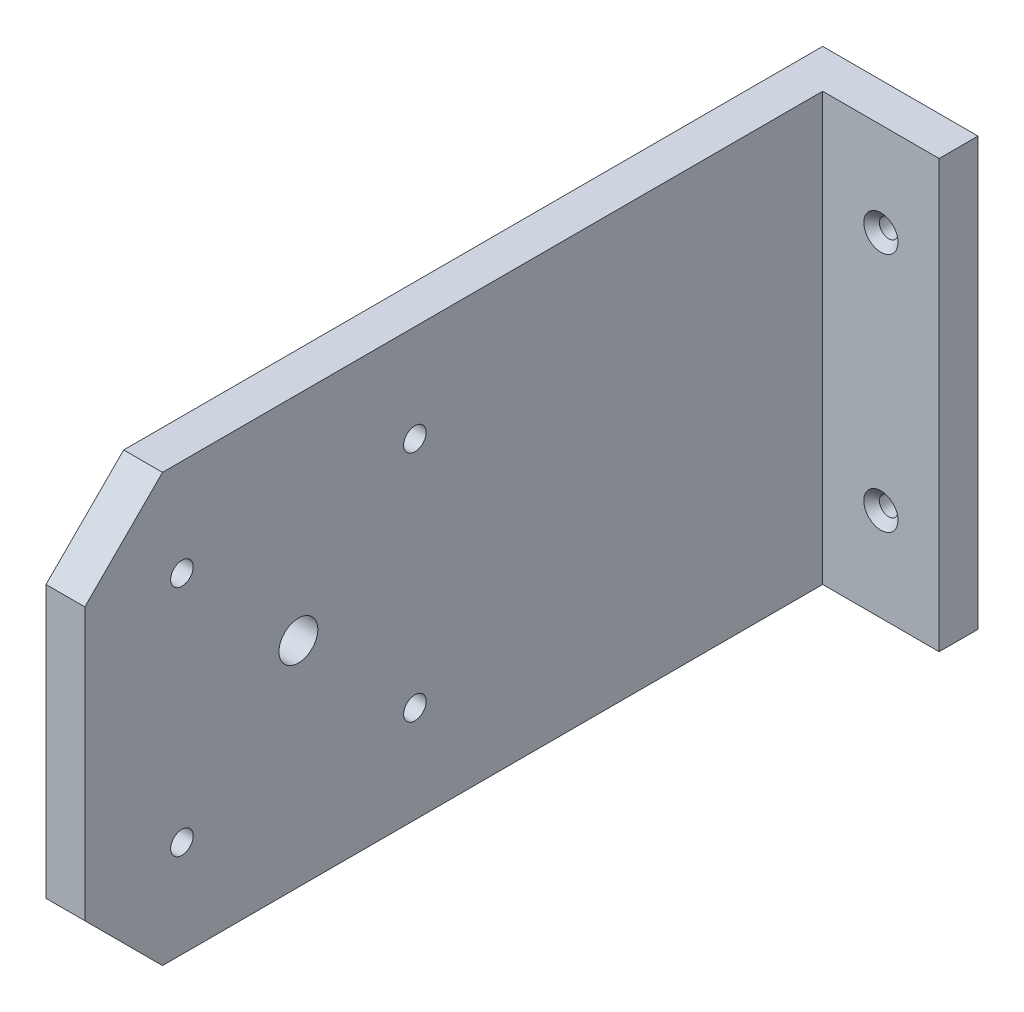
ISO-10303-21;
HEADER;
FILE_DESCRIPTION(('STEP AP214'),'2;1');
FILE_NAME('part.step','',(''),(''),'','','');
FILE_SCHEMA(('AUTOMOTIVE_DESIGN { 1 0 10303 214 1 1 1 1 }'));
ENDSEC;
DATA;
#1=APPLICATION_CONTEXT('core data for automotive mechanical design processes');
#2=APPLICATION_PROTOCOL_DEFINITION('international standard','automotive_design',2000,#1);
#3=PRODUCT_CONTEXT('',#1,'mechanical');
#4=PRODUCT('Part','Part','',(#3));
#5=PRODUCT_RELATED_PRODUCT_CATEGORY('part','',(#4));
#6=PRODUCT_DEFINITION_FORMATION('','',#4);
#7=PRODUCT_DEFINITION_CONTEXT('part definition',#1,'design');
#8=PRODUCT_DEFINITION('design','',#6,#7);
#9=PRODUCT_DEFINITION_SHAPE('','',#8);
#10=(LENGTH_UNIT() NAMED_UNIT(*) SI_UNIT(.MILLI.,.METRE.));
#11=(NAMED_UNIT(*) PLANE_ANGLE_UNIT() SI_UNIT($,.RADIAN.));
#12=(NAMED_UNIT(*) SI_UNIT($,.STERADIAN.) SOLID_ANGLE_UNIT());
#13=UNCERTAINTY_MEASURE_WITH_UNIT(LENGTH_MEASURE(1.E-05),#10,'distance_accuracy_value','');
#14=(GEOMETRIC_REPRESENTATION_CONTEXT(3) GLOBAL_UNCERTAINTY_ASSIGNED_CONTEXT((#13)) GLOBAL_UNIT_ASSIGNED_CONTEXT((#10,
#11,#12)) REPRESENTATION_CONTEXT('',''));
#15=CARTESIAN_POINT('',(0.,0.,0.));
#16=DIRECTION('',(0.,0.,1.));
#17=DIRECTION('',(1.,0.,0.));
#18=AXIS2_PLACEMENT_3D('',#15,#16,#17);
#19=CARTESIAN_POINT('',(0.,0.,0.));
#20=DIRECTION('',(1.,0.,0.));
#21=DIRECTION('',(0.,0.,-1.));
#22=AXIS2_PLACEMENT_3D('',#19,#20,#21);
#23=PLANE('',#22);
#24=DIRECTION('',(0.,0.,-1.));
#25=VECTOR('',#24,1.);
#26=CARTESIAN_POINT('',(0.,-27.5,50.));
#27=LINE('',#26,#25);
#28=CARTESIAN_POINT('',(0.,-27.5,39.9999999999999));
#29=VERTEX_POINT('',#28);
#30=CARTESIAN_POINT('',(0.,-27.5,-50.));
#31=VERTEX_POINT('',#30);
#32=EDGE_CURVE('E123',#29,#31,#27,.T.);
#33=ORIENTED_EDGE('',*,*,#32,.F.);
#34=DIRECTION('',(0.,-0.707106781186544,-0.707106781186551));
#35=VECTOR('',#34,1.);
#36=CARTESIAN_POINT('',(0.,-27.5,39.9999999999999));
#37=LINE('',#36,#35);
#38=CARTESIAN_POINT('',(0.,-17.5,50.));
#39=VERTEX_POINT('',#38);
#40=EDGE_CURVE('E116',#39,#29,#37,.T.);
#41=ORIENTED_EDGE('',*,*,#40,.F.);
#42=DIRECTION('',(0.,-1.,0.));
#43=VECTOR('',#42,1.);
#44=CARTESIAN_POINT('',(0.,27.5,50.));
#45=LINE('',#44,#43);
#46=CARTESIAN_POINT('',(0.,17.4999999999999,50.));
#47=VERTEX_POINT('',#46);
#48=EDGE_CURVE('E115',#47,#39,#45,.T.);
#49=ORIENTED_EDGE('',*,*,#48,.F.);
#50=DIRECTION('',(0.,-0.707106781186551,0.707106781186544));
#51=VECTOR('',#50,1.);
#52=CARTESIAN_POINT('',(0.,27.5,40.));
#53=LINE('',#52,#51);
#54=CARTESIAN_POINT('',(0.,27.5,40.));
#55=VERTEX_POINT('',#54);
#56=EDGE_CURVE('E160',#55,#47,#53,.T.);
#57=ORIENTED_EDGE('',*,*,#56,.F.);
#58=DIRECTION('',(0.,0.,1.));
#59=VECTOR('',#58,1.);
#60=CARTESIAN_POINT('',(0.,27.5,50.));
#61=LINE('',#60,#59);
#62=CARTESIAN_POINT('',(0.,27.5,-50.));
#63=VERTEX_POINT('',#62);
#64=EDGE_CURVE('E133',#63,#55,#61,.T.);
#65=ORIENTED_EDGE('',*,*,#64,.F.);
#66=DIRECTION('',(0.,1.,0.));
#67=VECTOR('',#66,1.);
#68=CARTESIAN_POINT('',(0.,27.5,-50.));
#69=LINE('',#68,#67);
#70=EDGE_CURVE('E130',#31,#63,#69,.T.);
#71=ORIENTED_EDGE('',*,*,#70,.F.);
#72=EDGE_LOOP('',(#33,#41,#49,#57,#65,#71));
#73=FACE_BOUND('',#72,.T.);
#74=CARTESIAN_POINT('',(0.,0.,22.5));
#75=DIRECTION('',(-1.,0.,0.));
#76=DIRECTION('',(0.,0.,1.));
#77=AXIS2_PLACEMENT_3D('',#74,#75,#76);
#78=CIRCLE('',#77,2.49999999999999);
#79=CARTESIAN_POINT('',(0.,0.,25.));
#80=VERTEX_POINT('',#79);
#81=EDGE_CURVE('E184',#80,#80,#78,.T.);
#82=ORIENTED_EDGE('',*,*,#81,.F.);
#83=EDGE_LOOP('',(#82));
#84=FACE_BOUND('',#83,.T.);
#85=CARTESIAN_POINT('',(0.,15.,37.5));
#86=DIRECTION('',(-1.,0.,0.));
#87=DIRECTION('',(0.,0.,1.));
#88=AXIS2_PLACEMENT_3D('',#85,#86,#87);
#89=CIRCLE('',#88,2.75);
#90=CARTESIAN_POINT('',(0.,15.,40.25));
#91=VERTEX_POINT('',#90);
#92=EDGE_CURVE('E196',#91,#91,#89,.T.);
#93=ORIENTED_EDGE('',*,*,#92,.F.);
#94=EDGE_LOOP('',(#93));
#95=FACE_BOUND('',#94,.T.);
#96=CARTESIAN_POINT('',(0.,-15.,37.5));
#97=DIRECTION('',(-1.,0.,0.));
#98=DIRECTION('',(0.,0.,1.));
#99=AXIS2_PLACEMENT_3D('',#96,#97,#98);
#100=CIRCLE('',#99,2.75);
#101=CARTESIAN_POINT('',(0.,-15.,40.25));
#102=VERTEX_POINT('',#101);
#103=EDGE_CURVE('E205',#102,#102,#100,.T.);
#104=ORIENTED_EDGE('',*,*,#103,.F.);
#105=EDGE_LOOP('',(#104));
#106=FACE_BOUND('',#105,.T.);
#107=CARTESIAN_POINT('',(0.,-15.,7.49999999999997));
#108=DIRECTION('',(-1.,0.,0.));
#109=DIRECTION('',(0.,0.,1.));
#110=AXIS2_PLACEMENT_3D('',#107,#108,#109);
#111=CIRCLE('',#110,2.75);
#112=CARTESIAN_POINT('',(0.,-15.,10.25));
#113=VERTEX_POINT('',#112);
#114=EDGE_CURVE('E214',#113,#113,#111,.T.);
#115=ORIENTED_EDGE('',*,*,#114,.F.);
#116=EDGE_LOOP('',(#115));
#117=FACE_BOUND('',#116,.T.);
#118=CARTESIAN_POINT('',(0.,15.,7.49999999999997));
#119=DIRECTION('',(-1.,0.,0.));
#120=DIRECTION('',(0.,0.,1.));
#121=AXIS2_PLACEMENT_3D('',#118,#119,#120);
#122=CIRCLE('',#121,2.75);
#123=CARTESIAN_POINT('',(0.,15.,10.25));
#124=VERTEX_POINT('',#123);
#125=EDGE_CURVE('E223',#124,#124,#122,.T.);
#126=ORIENTED_EDGE('',*,*,#125,.F.);
#127=EDGE_LOOP('',(#126));
#128=FACE_BOUND('',#127,.T.);
#129=ADVANCED_FACE('F33',(#73,#84,#95,#106,#117,#128),#23,.F.);
#130=CARTESIAN_POINT('',(5.,27.5,-50.));
#131=DIRECTION('',(0.,0.,1.));
#132=DIRECTION('',(1.,0.,0.));
#133=AXIS2_PLACEMENT_3D('',#130,#131,#132);
#134=PLANE('',#133);
#135=CARTESIAN_POINT('',(12.5,15.5,-50.));
#136=DIRECTION('',(0.,0.,1.));
#137=DIRECTION('',(1.,0.,0.));
#138=AXIS2_PLACEMENT_3D('',#135,#136,#137);
#139=CIRCLE('',#138,1.2);
#140=CARTESIAN_POINT('',(13.7,15.5,-50.));
#141=VERTEX_POINT('',#140);
#142=EDGE_CURVE('E175',#141,#141,#139,.T.);
#143=ORIENTED_EDGE('',*,*,#142,.T.);
#144=EDGE_LOOP('',(#143));
#145=FACE_BOUND('',#144,.T.);
#146=CARTESIAN_POINT('',(12.5,-15.5,-50.));
#147=DIRECTION('',(0.,0.,1.));
#148=DIRECTION('',(1.,0.,0.));
#149=AXIS2_PLACEMENT_3D('',#146,#147,#148);
#150=CIRCLE('',#149,1.2);
#151=CARTESIAN_POINT('',(13.7,-15.5,-50.));
#152=VERTEX_POINT('',#151);
#153=EDGE_CURVE('E166',#152,#152,#150,.T.);
#154=ORIENTED_EDGE('',*,*,#153,.T.);
#155=EDGE_LOOP('',(#154));
#156=FACE_BOUND('',#155,.T.);
#157=ORIENTED_EDGE('',*,*,#70,.T.);
#158=DIRECTION('',(-1.,0.,0.));
#159=VECTOR('',#158,1.);
#160=CARTESIAN_POINT('',(5.,27.5,-50.));
#161=LINE('',#160,#159);
#162=CARTESIAN_POINT('',(20.,27.5,-50.));
#163=VERTEX_POINT('',#162);
#164=EDGE_CURVE('E11',#163,#63,#161,.T.);
#165=ORIENTED_EDGE('',*,*,#164,.F.);
#166=DIRECTION('',(0.,1.,0.));
#167=VECTOR('',#166,1.);
#168=CARTESIAN_POINT('',(20.,27.5,-50.));
#169=LINE('',#168,#167);
#170=CARTESIAN_POINT('',(20.,-27.5,-50.));
#171=VERTEX_POINT('',#170);
#172=EDGE_CURVE('E144',#171,#163,#169,.T.);
#173=ORIENTED_EDGE('',*,*,#172,.F.);
#174=DIRECTION('',(-1.,0.,0.));
#175=VECTOR('',#174,1.);
#176=CARTESIAN_POINT('',(5.,-27.5,-50.));
#177=LINE('',#176,#175);
#178=EDGE_CURVE('E43',#171,#31,#177,.T.);
#179=ORIENTED_EDGE('',*,*,#178,.T.);
#180=EDGE_LOOP('',(#157,#165,#173,#179));
#181=FACE_BOUND('',#180,.T.);
#182=ADVANCED_FACE('F35',(#145,#156,#181),#134,.F.);
#183=CARTESIAN_POINT('',(5.,27.5,50.));
#184=DIRECTION('',(0.,-1.,0.));
#185=DIRECTION('',(0.,0.,-1.));
#186=AXIS2_PLACEMENT_3D('',#183,#184,#185);
#187=PLANE('',#186);
#188=ORIENTED_EDGE('',*,*,#64,.T.);
#189=DIRECTION('',(-1.,0.,0.));
#190=VECTOR('',#189,1.);
#191=CARTESIAN_POINT('',(20.001025,27.5,40.));
#192=LINE('',#191,#190);
#193=CARTESIAN_POINT('',(5.,27.5,40.));
#194=VERTEX_POINT('',#193);
#195=EDGE_CURVE('E59',#194,#55,#192,.T.);
#196=ORIENTED_EDGE('',*,*,#195,.F.);
#197=DIRECTION('',(0.,0.,1.));
#198=VECTOR('',#197,1.);
#199=CARTESIAN_POINT('',(5.,27.5,50.));
#200=LINE('',#199,#198);
#201=CARTESIAN_POINT('',(5.,27.5,-45.));
#202=VERTEX_POINT('',#201);
#203=EDGE_CURVE('E121',#202,#194,#200,.T.);
#204=ORIENTED_EDGE('',*,*,#203,.F.);
#205=DIRECTION('',(-1.,0.,0.));
#206=VECTOR('',#205,1.);
#207=CARTESIAN_POINT('',(20.,27.5,-45.));
#208=LINE('',#207,#206);
#209=CARTESIAN_POINT('',(20.,27.5,-45.));
#210=VERTEX_POINT('',#209);
#211=EDGE_CURVE('E134',#210,#202,#208,.T.);
#212=ORIENTED_EDGE('',*,*,#211,.F.);
#213=DIRECTION('',(0.,0.,1.));
#214=VECTOR('',#213,1.);
#215=CARTESIAN_POINT('',(20.,27.5,-50.));
#216=LINE('',#215,#214);
#217=EDGE_CURVE('E155',#163,#210,#216,.T.);
#218=ORIENTED_EDGE('',*,*,#217,.F.);
#219=ORIENTED_EDGE('',*,*,#164,.T.);
#220=EDGE_LOOP('',(#188,#196,#204,#212,#218,#219));
#221=FACE_BOUND('',#220,.T.);
#222=ADVANCED_FACE('F237',(#221),#187,.F.);
#223=CARTESIAN_POINT('',(5.,27.5,50.));
#224=DIRECTION('',(0.,0.,-1.));
#225=DIRECTION('',(0.,1.,0.));
#226=AXIS2_PLACEMENT_3D('',#223,#224,#225);
#227=PLANE('',#226);
#228=ORIENTED_EDGE('',*,*,#48,.T.);
#229=DIRECTION('',(-1.,0.,0.));
#230=VECTOR('',#229,1.);
#231=CARTESIAN_POINT('',(20.001025,-17.5,50.));
#232=LINE('',#231,#230);
#233=CARTESIAN_POINT('',(5.,-17.5,50.));
#234=VERTEX_POINT('',#233);
#235=EDGE_CURVE('E51',#234,#39,#232,.T.);
#236=ORIENTED_EDGE('',*,*,#235,.F.);
#237=DIRECTION('',(0.,-1.,0.));
#238=VECTOR('',#237,1.);
#239=CARTESIAN_POINT('',(5.,27.5,50.));
#240=LINE('',#239,#238);
#241=CARTESIAN_POINT('',(5.,17.4999999999999,50.));
#242=VERTEX_POINT('',#241);
#243=EDGE_CURVE('E113',#242,#234,#240,.T.);
#244=ORIENTED_EDGE('',*,*,#243,.F.);
#245=DIRECTION('',(-1.,0.,0.));
#246=VECTOR('',#245,1.);
#247=CARTESIAN_POINT('',(20.001025,17.4999999999999,50.));
#248=LINE('',#247,#246);
#249=EDGE_CURVE('E145',#242,#47,#248,.T.);
#250=ORIENTED_EDGE('',*,*,#249,.T.);
#251=EDGE_LOOP('',(#228,#236,#244,#250));
#252=FACE_BOUND('',#251,.T.);
#253=ADVANCED_FACE('F111',(#252),#227,.F.);
#254=CARTESIAN_POINT('',(5.,-27.5,50.));
#255=DIRECTION('',(0.,1.,0.));
#256=DIRECTION('',(0.,0.,1.));
#257=AXIS2_PLACEMENT_3D('',#254,#255,#256);
#258=PLANE('',#257);
#259=DIRECTION('',(0.,0.,-1.));
#260=VECTOR('',#259,1.);
#261=CARTESIAN_POINT('',(5.,-27.5,50.));
#262=LINE('',#261,#260);
#263=CARTESIAN_POINT('',(5.,-27.5,39.9999999999999));
#264=VERTEX_POINT('',#263);
#265=CARTESIAN_POINT('',(5.,-27.5,-45.));
#266=VERTEX_POINT('',#265);
#267=EDGE_CURVE('E37',#264,#266,#262,.T.);
#268=ORIENTED_EDGE('',*,*,#267,.F.);
#269=DIRECTION('',(-1.,0.,0.));
#270=VECTOR('',#269,1.);
#271=CARTESIAN_POINT('',(20.001025,-27.5,39.9999999999999));
#272=LINE('',#271,#270);
#273=EDGE_CURVE('E102',#264,#29,#272,.T.);
#274=ORIENTED_EDGE('',*,*,#273,.T.);
#275=ORIENTED_EDGE('',*,*,#32,.T.);
#276=ORIENTED_EDGE('',*,*,#178,.F.);
#277=DIRECTION('',(0.,0.,-1.));
#278=VECTOR('',#277,1.);
#279=CARTESIAN_POINT('',(20.,-27.5,-50.));
#280=LINE('',#279,#278);
#281=CARTESIAN_POINT('',(20.,-27.5,-45.));
#282=VERTEX_POINT('',#281);
#283=EDGE_CURVE('E150',#282,#171,#280,.T.);
#284=ORIENTED_EDGE('',*,*,#283,.F.);
#285=DIRECTION('',(-1.,0.,0.));
#286=VECTOR('',#285,1.);
#287=CARTESIAN_POINT('',(20.,-27.5,-45.));
#288=LINE('',#287,#286);
#289=EDGE_CURVE('E146',#282,#266,#288,.T.);
#290=ORIENTED_EDGE('',*,*,#289,.T.);
#291=EDGE_LOOP('',(#268,#274,#275,#276,#284,#290));
#292=FACE_BOUND('',#291,.T.);
#293=ADVANCED_FACE('F244',(#292),#258,.F.);
#294=CARTESIAN_POINT('',(5.,0.,0.));
#295=DIRECTION('',(1.,0.,0.));
#296=DIRECTION('',(0.,0.,-1.));
#297=AXIS2_PLACEMENT_3D('',#294,#295,#296);
#298=PLANE('',#297);
#299=CARTESIAN_POINT('',(5.,15.,7.49999999999997));
#300=DIRECTION('',(1.,0.,0.));
#301=DIRECTION('',(0.,0.,-1.));
#302=AXIS2_PLACEMENT_3D('',#299,#300,#301);
#303=CIRCLE('',#302,1.45);
#304=CARTESIAN_POINT('',(5.,15.,6.04999999999997));
#305=VERTEX_POINT('',#304);
#306=EDGE_CURVE('E217',#305,#305,#303,.T.);
#307=ORIENTED_EDGE('',*,*,#306,.F.);
#308=EDGE_LOOP('',(#307));
#309=FACE_BOUND('',#308,.T.);
#310=CARTESIAN_POINT('',(5.,-15.,7.49999999999997));
#311=DIRECTION('',(1.,0.,0.));
#312=DIRECTION('',(0.,0.,-1.));
#313=AXIS2_PLACEMENT_3D('',#310,#311,#312);
#314=CIRCLE('',#313,1.45);
#315=CARTESIAN_POINT('',(5.,-15.,6.04999999999997));
#316=VERTEX_POINT('',#315);
#317=EDGE_CURVE('E208',#316,#316,#314,.T.);
#318=ORIENTED_EDGE('',*,*,#317,.F.);
#319=EDGE_LOOP('',(#318));
#320=FACE_BOUND('',#319,.T.);
#321=CARTESIAN_POINT('',(5.,-15.,37.5));
#322=DIRECTION('',(1.,0.,0.));
#323=DIRECTION('',(0.,0.,-1.));
#324=AXIS2_PLACEMENT_3D('',#321,#322,#323);
#325=CIRCLE('',#324,1.45);
#326=CARTESIAN_POINT('',(5.,-15.,36.05));
#327=VERTEX_POINT('',#326);
#328=EDGE_CURVE('E199',#327,#327,#325,.T.);
#329=ORIENTED_EDGE('',*,*,#328,.F.);
#330=EDGE_LOOP('',(#329));
#331=FACE_BOUND('',#330,.T.);
#332=CARTESIAN_POINT('',(5.,15.,37.5));
#333=DIRECTION('',(1.,0.,0.));
#334=DIRECTION('',(0.,0.,-1.));
#335=AXIS2_PLACEMENT_3D('',#332,#333,#334);
#336=CIRCLE('',#335,1.45);
#337=CARTESIAN_POINT('',(5.,15.,36.05));
#338=VERTEX_POINT('',#337);
#339=EDGE_CURVE('E188',#338,#338,#336,.T.);
#340=ORIENTED_EDGE('',*,*,#339,.F.);
#341=EDGE_LOOP('',(#340));
#342=FACE_BOUND('',#341,.T.);
#343=CARTESIAN_POINT('',(5.,0.,22.5));
#344=DIRECTION('',(1.,0.,0.));
#345=DIRECTION('',(0.,0.,-1.));
#346=AXIS2_PLACEMENT_3D('',#343,#344,#345);
#347=CIRCLE('',#346,2.49999999999999);
#348=CARTESIAN_POINT('',(5.,0.,20.));
#349=VERTEX_POINT('',#348);
#350=EDGE_CURVE('E185',#349,#349,#347,.F.);
#351=ORIENTED_EDGE('',*,*,#350,.T.);
#352=EDGE_LOOP('',(#351));
#353=FACE_BOUND('',#352,.T.);
#354=DIRECTION('',(0.,-0.707106781186544,-0.707106781186551));
#355=VECTOR('',#354,1.);
#356=CARTESIAN_POINT('',(5.,-27.5,39.9999999999999));
#357=LINE('',#356,#355);
#358=EDGE_CURVE('E99',#234,#264,#357,.T.);
#359=ORIENTED_EDGE('',*,*,#358,.T.);
#360=ORIENTED_EDGE('',*,*,#267,.T.);
#361=DIRECTION('',(0.,-1.,0.));
#362=VECTOR('',#361,1.);
#363=CARTESIAN_POINT('',(5.,27.5,-45.));
#364=LINE('',#363,#362);
#365=EDGE_CURVE('E141',#202,#266,#364,.T.);
#366=ORIENTED_EDGE('',*,*,#365,.F.);
#367=ORIENTED_EDGE('',*,*,#203,.T.);
#368=DIRECTION('',(0.,-0.707106781186551,0.707106781186544));
#369=VECTOR('',#368,1.);
#370=CARTESIAN_POINT('',(5.,27.5,40.));
#371=LINE('',#370,#369);
#372=EDGE_CURVE('E106',#194,#242,#371,.T.);
#373=ORIENTED_EDGE('',*,*,#372,.T.);
#374=ORIENTED_EDGE('',*,*,#243,.T.);
#375=EDGE_LOOP('',(#359,#360,#366,#367,#373,#374));
#376=FACE_BOUND('',#375,.T.);
#377=ADVANCED_FACE('F119',(#309,#320,#331,#342,#353,#376),#298,.T.);
#378=CARTESIAN_POINT('',(20.,27.5,-45.));
#379=DIRECTION('',(0.,0.,-1.));
#380=DIRECTION('',(0.,1.,0.));
#381=AXIS2_PLACEMENT_3D('',#378,#379,#380);
#382=PLANE('',#381);
#383=CARTESIAN_POINT('',(12.5,15.5,-45.));
#384=DIRECTION('',(0.,0.,1.));
#385=DIRECTION('',(1.,0.,0.));
#386=AXIS2_PLACEMENT_3D('',#383,#384,#385);
#387=CIRCLE('',#386,2.2);
#388=CARTESIAN_POINT('',(14.7,15.5,-45.));
#389=VERTEX_POINT('',#388);
#390=EDGE_CURVE('E181',#389,#389,#387,.T.);
#391=ORIENTED_EDGE('',*,*,#390,.F.);
#392=EDGE_LOOP('',(#391));
#393=FACE_BOUND('',#392,.T.);
#394=CARTESIAN_POINT('',(12.5,-15.5,-45.));
#395=DIRECTION('',(0.,0.,1.));
#396=DIRECTION('',(1.,0.,0.));
#397=AXIS2_PLACEMENT_3D('',#394,#395,#396);
#398=CIRCLE('',#397,2.2);
#399=CARTESIAN_POINT('',(14.7,-15.5,-45.));
#400=VERTEX_POINT('',#399);
#401=EDGE_CURVE('E172',#400,#400,#398,.T.);
#402=ORIENTED_EDGE('',*,*,#401,.F.);
#403=EDGE_LOOP('',(#402));
#404=FACE_BOUND('',#403,.T.);
#405=ORIENTED_EDGE('',*,*,#365,.T.);
#406=ORIENTED_EDGE('',*,*,#289,.F.);
#407=DIRECTION('',(0.,-1.,0.));
#408=VECTOR('',#407,1.);
#409=CARTESIAN_POINT('',(20.,27.5,-45.));
#410=LINE('',#409,#408);
#411=EDGE_CURVE('E153',#210,#282,#410,.T.);
#412=ORIENTED_EDGE('',*,*,#411,.F.);
#413=ORIENTED_EDGE('',*,*,#211,.T.);
#414=EDGE_LOOP('',(#405,#406,#412,#413));
#415=FACE_BOUND('',#414,.T.);
#416=ADVANCED_FACE('F267',(#393,#404,#415),#382,.F.);
#417=CARTESIAN_POINT('',(20.,0.,0.));
#418=DIRECTION('',(-1.,0.,0.));
#419=DIRECTION('',(0.,0.,1.));
#420=AXIS2_PLACEMENT_3D('',#417,#418,#419);
#421=PLANE('',#420);
#422=ORIENTED_EDGE('',*,*,#172,.T.);
#423=ORIENTED_EDGE('',*,*,#217,.T.);
#424=ORIENTED_EDGE('',*,*,#411,.T.);
#425=ORIENTED_EDGE('',*,*,#283,.T.);
#426=EDGE_LOOP('',(#422,#423,#424,#425));
#427=FACE_BOUND('',#426,.T.);
#428=ADVANCED_FACE('F259',(#427),#421,.F.);
#429=CARTESIAN_POINT('',(20.001025,27.5,40.));
#430=DIRECTION('',(0.,-0.707106781186544,-0.707106781186551));
#431=DIRECTION('',(0.,0.707106781186551,-0.707106781186544));
#432=AXIS2_PLACEMENT_3D('',#429,#430,#431);
#433=PLANE('',#432);
#434=ORIENTED_EDGE('',*,*,#195,.T.);
#435=ORIENTED_EDGE('',*,*,#56,.T.);
#436=ORIENTED_EDGE('',*,*,#249,.F.);
#437=ORIENTED_EDGE('',*,*,#372,.F.);
#438=EDGE_LOOP('',(#434,#435,#436,#437));
#439=FACE_BOUND('',#438,.T.);
#440=ADVANCED_FACE('F257',(#439),#433,.F.);
#441=CARTESIAN_POINT('',(20.001025,-27.5,39.9999999999999));
#442=DIRECTION('',(0.,0.707106781186551,-0.707106781186544));
#443=DIRECTION('',(0.,0.707106781186544,0.707106781186551));
#444=AXIS2_PLACEMENT_3D('',#441,#442,#443);
#445=PLANE('',#444);
#446=ORIENTED_EDGE('',*,*,#235,.T.);
#447=ORIENTED_EDGE('',*,*,#40,.T.);
#448=ORIENTED_EDGE('',*,*,#273,.F.);
#449=ORIENTED_EDGE('',*,*,#358,.F.);
#450=EDGE_LOOP('',(#446,#447,#448,#449));
#451=FACE_BOUND('',#450,.T.);
#452=ADVANCED_FACE('F100',(#451),#445,.F.);
#453=CARTESIAN_POINT('',(12.5,-15.5,-45.));
#454=DIRECTION('',(0.,0.,1.));
#455=DIRECTION('',(1.,0.,0.));
#456=AXIS2_PLACEMENT_3D('',#453,#454,#455);
#457=CYLINDRICAL_SURFACE('',#456,1.2);
#458=ORIENTED_EDGE('',*,*,#153,.F.);
#459=EDGE_LOOP('',(#458));
#460=FACE_BOUND('',#459,.T.);
#461=CARTESIAN_POINT('',(12.5,-15.5,-46.));
#462=DIRECTION('',(0.,0.,1.));
#463=DIRECTION('',(1.,0.,0.));
#464=AXIS2_PLACEMENT_3D('',#461,#462,#463);
#465=CIRCLE('',#464,1.2);
#466=CARTESIAN_POINT('',(13.7,-15.5,-46.));
#467=VERTEX_POINT('',#466);
#468=EDGE_CURVE('E169',#467,#467,#465,.T.);
#469=ORIENTED_EDGE('',*,*,#468,.T.);
#470=EDGE_LOOP('',(#469));
#471=FACE_BOUND('',#470,.T.);
#472=ADVANCED_FACE('F265',(#460,#471),#457,.F.);
#473=CARTESIAN_POINT('',(12.5,-15.5,-45.));
#474=DIRECTION('',(0.,0.,1.));
#475=DIRECTION('',(1.,0.,0.));
#476=AXIS2_PLACEMENT_3D('',#473,#474,#475);
#477=CONICAL_SURFACE('',#476,2.2,0.785398163397448);
#478=ORIENTED_EDGE('',*,*,#468,.F.);
#479=EDGE_LOOP('',(#478));
#480=FACE_BOUND('',#479,.T.);
#481=ORIENTED_EDGE('',*,*,#401,.T.);
#482=EDGE_LOOP('',(#481));
#483=FACE_BOUND('',#482,.T.);
#484=ADVANCED_FACE('F293',(#480,#483),#477,.F.);
#485=CARTESIAN_POINT('',(12.5,15.5,-45.));
#486=DIRECTION('',(0.,0.,1.));
#487=DIRECTION('',(1.,0.,0.));
#488=AXIS2_PLACEMENT_3D('',#485,#486,#487);
#489=CYLINDRICAL_SURFACE('',#488,1.2);
#490=ORIENTED_EDGE('',*,*,#142,.F.);
#491=EDGE_LOOP('',(#490));
#492=FACE_BOUND('',#491,.T.);
#493=CARTESIAN_POINT('',(12.5,15.5,-46.));
#494=DIRECTION('',(0.,0.,1.));
#495=DIRECTION('',(1.,0.,0.));
#496=AXIS2_PLACEMENT_3D('',#493,#494,#495);
#497=CIRCLE('',#496,1.2);
#498=CARTESIAN_POINT('',(13.7,15.5,-46.));
#499=VERTEX_POINT('',#498);
#500=EDGE_CURVE('E178',#499,#499,#497,.T.);
#501=ORIENTED_EDGE('',*,*,#500,.T.);
#502=EDGE_LOOP('',(#501));
#503=FACE_BOUND('',#502,.T.);
#504=ADVANCED_FACE('F295',(#492,#503),#489,.F.);
#505=CARTESIAN_POINT('',(12.5,15.5,-45.));
#506=DIRECTION('',(0.,0.,1.));
#507=DIRECTION('',(1.,0.,0.));
#508=AXIS2_PLACEMENT_3D('',#505,#506,#507);
#509=CONICAL_SURFACE('',#508,2.2,0.785398163397448);
#510=ORIENTED_EDGE('',*,*,#500,.F.);
#511=EDGE_LOOP('',(#510));
#512=FACE_BOUND('',#511,.T.);
#513=ORIENTED_EDGE('',*,*,#390,.T.);
#514=EDGE_LOOP('',(#513));
#515=FACE_BOUND('',#514,.T.);
#516=ADVANCED_FACE('F302',(#512,#515),#509,.F.);
#517=CARTESIAN_POINT('',(20.001025,0.,22.5));
#518=DIRECTION('',(-1.,0.,0.));
#519=DIRECTION('',(0.,0.,1.));
#520=AXIS2_PLACEMENT_3D('',#517,#518,#519);
#521=CYLINDRICAL_SURFACE('',#520,2.49999999999999);
#522=ORIENTED_EDGE('',*,*,#350,.F.);
#523=EDGE_LOOP('',(#522));
#524=FACE_BOUND('',#523,.T.);
#525=ORIENTED_EDGE('',*,*,#81,.T.);
#526=EDGE_LOOP('',(#525));
#527=FACE_BOUND('',#526,.T.);
#528=ADVANCED_FACE('F310',(#524,#527),#521,.F.);
#529=CARTESIAN_POINT('',(0.,15.,37.5));
#530=DIRECTION('',(-1.,0.,0.));
#531=DIRECTION('',(0.,0.,1.));
#532=AXIS2_PLACEMENT_3D('',#529,#530,#531);
#533=CYLINDRICAL_SURFACE('',#532,1.45);
#534=CARTESIAN_POINT('',(1.3,15.,37.5));
#535=DIRECTION('',(-1.,0.,0.));
#536=DIRECTION('',(0.,0.,1.));
#537=AXIS2_PLACEMENT_3D('',#534,#535,#536);
#538=CIRCLE('',#537,1.45);
#539=CARTESIAN_POINT('',(1.3,15.,38.95));
#540=VERTEX_POINT('',#539);
#541=EDGE_CURVE('E193',#540,#540,#538,.T.);
#542=ORIENTED_EDGE('',*,*,#541,.T.);
#543=EDGE_LOOP('',(#542));
#544=FACE_BOUND('',#543,.T.);
#545=ORIENTED_EDGE('',*,*,#339,.T.);
#546=EDGE_LOOP('',(#545));
#547=FACE_BOUND('',#546,.T.);
#548=ADVANCED_FACE('F314',(#544,#547),#533,.F.);
#549=CARTESIAN_POINT('',(0.,15.,37.5));
#550=DIRECTION('',(-1.,0.,0.));
#551=DIRECTION('',(0.,0.,1.));
#552=AXIS2_PLACEMENT_3D('',#549,#550,#551);
#553=CONICAL_SURFACE('',#552,2.75,0.785398163397449);
#554=ORIENTED_EDGE('',*,*,#541,.F.);
#555=EDGE_LOOP('',(#554));
#556=FACE_BOUND('',#555,.T.);
#557=ORIENTED_EDGE('',*,*,#92,.T.);
#558=EDGE_LOOP('',(#557));
#559=FACE_BOUND('',#558,.T.);
#560=ADVANCED_FACE('F318',(#556,#559),#553,.F.);
#561=CARTESIAN_POINT('',(0.,-15.,37.5));
#562=DIRECTION('',(-1.,0.,0.));
#563=DIRECTION('',(0.,0.,1.));
#564=AXIS2_PLACEMENT_3D('',#561,#562,#563);
#565=CYLINDRICAL_SURFACE('',#564,1.45);
#566=CARTESIAN_POINT('',(1.3,-15.,37.5));
#567=DIRECTION('',(-1.,0.,0.));
#568=DIRECTION('',(0.,0.,1.));
#569=AXIS2_PLACEMENT_3D('',#566,#567,#568);
#570=CIRCLE('',#569,1.45);
#571=CARTESIAN_POINT('',(1.3,-15.,38.95));
#572=VERTEX_POINT('',#571);
#573=EDGE_CURVE('E202',#572,#572,#570,.T.);
#574=ORIENTED_EDGE('',*,*,#573,.T.);
#575=EDGE_LOOP('',(#574));
#576=FACE_BOUND('',#575,.T.);
#577=ORIENTED_EDGE('',*,*,#328,.T.);
#578=EDGE_LOOP('',(#577));
#579=FACE_BOUND('',#578,.T.);
#580=ADVANCED_FACE('F322',(#576,#579),#565,.F.);
#581=CARTESIAN_POINT('',(0.,-15.,37.5));
#582=DIRECTION('',(-1.,0.,0.));
#583=DIRECTION('',(0.,0.,1.));
#584=AXIS2_PLACEMENT_3D('',#581,#582,#583);
#585=CONICAL_SURFACE('',#584,2.75,0.785398163397448);
#586=ORIENTED_EDGE('',*,*,#573,.F.);
#587=EDGE_LOOP('',(#586));
#588=FACE_BOUND('',#587,.T.);
#589=ORIENTED_EDGE('',*,*,#103,.T.);
#590=EDGE_LOOP('',(#589));
#591=FACE_BOUND('',#590,.T.);
#592=ADVANCED_FACE('F326',(#588,#591),#585,.F.);
#593=CARTESIAN_POINT('',(0.,-15.,7.49999999999997));
#594=DIRECTION('',(-1.,0.,0.));
#595=DIRECTION('',(0.,0.,1.));
#596=AXIS2_PLACEMENT_3D('',#593,#594,#595);
#597=CYLINDRICAL_SURFACE('',#596,1.45);
#598=CARTESIAN_POINT('',(1.3,-15.,7.49999999999997));
#599=DIRECTION('',(-1.,0.,0.));
#600=DIRECTION('',(0.,0.,1.));
#601=AXIS2_PLACEMENT_3D('',#598,#599,#600);
#602=CIRCLE('',#601,1.45);
#603=CARTESIAN_POINT('',(1.3,-15.,8.94999999999997));
#604=VERTEX_POINT('',#603);
#605=EDGE_CURVE('E211',#604,#604,#602,.T.);
#606=ORIENTED_EDGE('',*,*,#605,.T.);
#607=EDGE_LOOP('',(#606));
#608=FACE_BOUND('',#607,.T.);
#609=ORIENTED_EDGE('',*,*,#317,.T.);
#610=EDGE_LOOP('',(#609));
#611=FACE_BOUND('',#610,.T.);
#612=ADVANCED_FACE('F330',(#608,#611),#597,.F.);
#613=CARTESIAN_POINT('',(0.,-15.,7.49999999999997));
#614=DIRECTION('',(-1.,0.,0.));
#615=DIRECTION('',(0.,0.,1.));
#616=AXIS2_PLACEMENT_3D('',#613,#614,#615);
#617=CONICAL_SURFACE('',#616,2.75,0.785398163397448);
#618=ORIENTED_EDGE('',*,*,#605,.F.);
#619=EDGE_LOOP('',(#618));
#620=FACE_BOUND('',#619,.T.);
#621=ORIENTED_EDGE('',*,*,#114,.T.);
#622=EDGE_LOOP('',(#621));
#623=FACE_BOUND('',#622,.T.);
#624=ADVANCED_FACE('F334',(#620,#623),#617,.F.);
#625=CARTESIAN_POINT('',(0.,15.,7.49999999999997));
#626=DIRECTION('',(-1.,0.,0.));
#627=DIRECTION('',(0.,0.,1.));
#628=AXIS2_PLACEMENT_3D('',#625,#626,#627);
#629=CYLINDRICAL_SURFACE('',#628,1.45);
#630=CARTESIAN_POINT('',(1.3,15.,7.49999999999997));
#631=DIRECTION('',(-1.,0.,0.));
#632=DIRECTION('',(0.,0.,1.));
#633=AXIS2_PLACEMENT_3D('',#630,#631,#632);
#634=CIRCLE('',#633,1.45);
#635=CARTESIAN_POINT('',(1.3,15.,8.94999999999997));
#636=VERTEX_POINT('',#635);
#637=EDGE_CURVE('E220',#636,#636,#634,.T.);
#638=ORIENTED_EDGE('',*,*,#637,.T.);
#639=EDGE_LOOP('',(#638));
#640=FACE_BOUND('',#639,.T.);
#641=ORIENTED_EDGE('',*,*,#306,.T.);
#642=EDGE_LOOP('',(#641));
#643=FACE_BOUND('',#642,.T.);
#644=ADVANCED_FACE('F338',(#640,#643),#629,.F.);
#645=CARTESIAN_POINT('',(0.,15.,7.49999999999997));
#646=DIRECTION('',(-1.,0.,0.));
#647=DIRECTION('',(0.,0.,1.));
#648=AXIS2_PLACEMENT_3D('',#645,#646,#647);
#649=CONICAL_SURFACE('',#648,2.75,0.785398163397448);
#650=ORIENTED_EDGE('',*,*,#637,.F.);
#651=EDGE_LOOP('',(#650));
#652=FACE_BOUND('',#651,.T.);
#653=ORIENTED_EDGE('',*,*,#125,.T.);
#654=EDGE_LOOP('',(#653));
#655=FACE_BOUND('',#654,.T.);
#656=ADVANCED_FACE('F227',(#652,#655),#649,.F.);
#657=CLOSED_SHELL('',(#129,#182,#222,#253,#293,#377,#416,#428,#440,#452,#472,#484,#504,#516,
#528,#548,#560,#580,#592,#612,#624,#644,#656));
#658=MANIFOLD_SOLID_BREP('B2',#657);
#659=ADVANCED_BREP_SHAPE_REPRESENTATION('',(#18,#658),#14);
#660=SHAPE_DEFINITION_REPRESENTATION(#9,#659);
ENDSEC;
END-ISO-10303-21;
